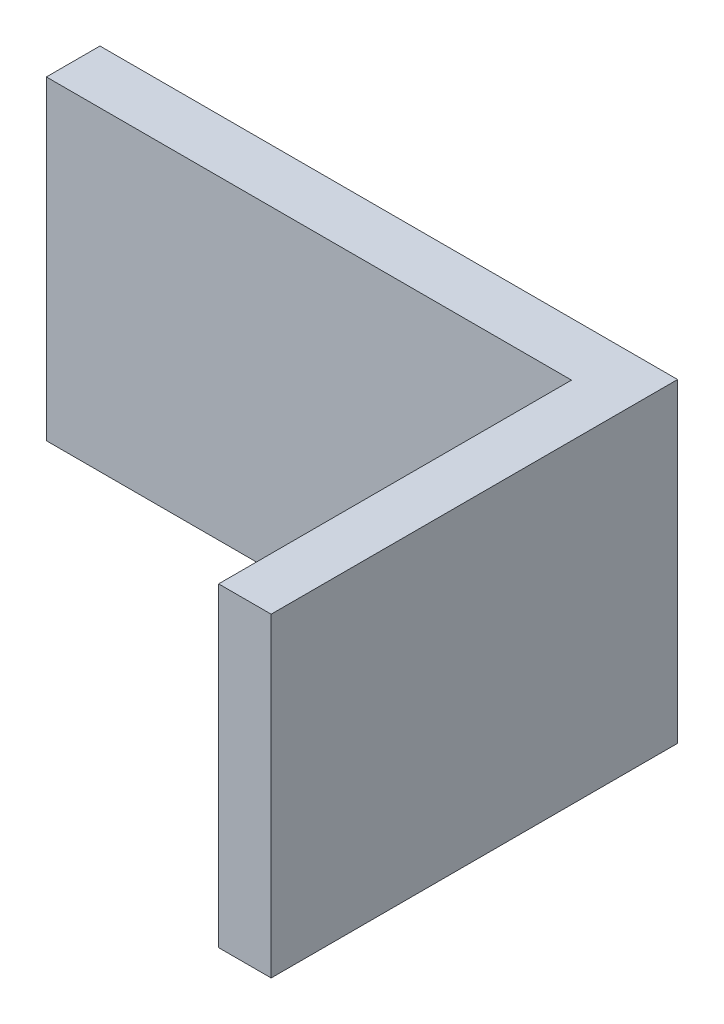
ISO-10303-21;
HEADER;
FILE_DESCRIPTION(('STEP AP214'),'2;1');
FILE_NAME('part.step','',(''),(''),'','','');
FILE_SCHEMA(('AUTOMOTIVE_DESIGN { 1 0 10303 214 1 1 1 1 }'));
ENDSEC;
DATA;
#1=APPLICATION_CONTEXT('core data for automotive mechanical design processes');
#2=APPLICATION_PROTOCOL_DEFINITION('international standard','automotive_design',2000,#1);
#3=PRODUCT_CONTEXT('',#1,'mechanical');
#4=PRODUCT('Part','Part','',(#3));
#5=PRODUCT_RELATED_PRODUCT_CATEGORY('part','',(#4));
#6=PRODUCT_DEFINITION_FORMATION('','',#4);
#7=PRODUCT_DEFINITION_CONTEXT('part definition',#1,'design');
#8=PRODUCT_DEFINITION('design','',#6,#7);
#9=PRODUCT_DEFINITION_SHAPE('','',#8);
#10=(LENGTH_UNIT() NAMED_UNIT(*) SI_UNIT(.MILLI.,.METRE.));
#11=(NAMED_UNIT(*) PLANE_ANGLE_UNIT() SI_UNIT($,.RADIAN.));
#12=(NAMED_UNIT(*) SI_UNIT($,.STERADIAN.) SOLID_ANGLE_UNIT());
#13=UNCERTAINTY_MEASURE_WITH_UNIT(LENGTH_MEASURE(1.E-05),#10,'distance_accuracy_value','');
#14=(GEOMETRIC_REPRESENTATION_CONTEXT(3) GLOBAL_UNCERTAINTY_ASSIGNED_CONTEXT((#13)) GLOBAL_UNIT_ASSIGNED_CONTEXT((#10,
#11,#12)) REPRESENTATION_CONTEXT('',''));
#15=CARTESIAN_POINT('',(0.,0.,0.));
#16=DIRECTION('',(0.,0.,1.));
#17=DIRECTION('',(1.,0.,0.));
#18=AXIS2_PLACEMENT_3D('',#15,#16,#17);
#19=CARTESIAN_POINT('',(4.55,-0.6,0.));
#20=DIRECTION('',(0.,1.,0.));
#21=DIRECTION('',(0.,0.,1.));
#22=AXIS2_PLACEMENT_3D('',#19,#20,#21);
#23=PLANE('',#22);
#24=DIRECTION('',(1.,0.,0.));
#25=VECTOR('',#24,1.);
#26=CARTESIAN_POINT('',(4.,-0.6,0.));
#27=LINE('',#26,#25);
#28=CARTESIAN_POINT('',(4.,-0.6,0.));
#29=VERTEX_POINT('',#28);
#30=CARTESIAN_POINT('',(4.55,-0.6,0.));
#31=VERTEX_POINT('',#30);
#32=EDGE_CURVE('E11',#29,#31,#27,.T.);
#33=ORIENTED_EDGE('',*,*,#32,.F.);
#34=DIRECTION('',(0.,0.,-1.));
#35=VECTOR('',#34,1.);
#36=CARTESIAN_POINT('',(4.,-0.6,0.051));
#37=LINE('',#36,#35);
#38=CARTESIAN_POINT('',(4.,-0.6,0.051));
#39=VERTEX_POINT('',#38);
#40=EDGE_CURVE('E24',#39,#29,#37,.T.);
#41=ORIENTED_EDGE('',*,*,#40,.F.);
#42=DIRECTION('',(-1.,0.,0.));
#43=VECTOR('',#42,1.);
#44=CARTESIAN_POINT('',(4.5,-0.6,0.051));
#45=LINE('',#44,#43);
#46=CARTESIAN_POINT('',(4.5,-0.6,0.051));
#47=VERTEX_POINT('',#46);
#48=EDGE_CURVE('E87',#47,#39,#45,.T.);
#49=ORIENTED_EDGE('',*,*,#48,.F.);
#50=DIRECTION('',(0.,0.,-1.));
#51=VECTOR('',#50,1.);
#52=CARTESIAN_POINT('',(4.5,-0.6,0.387));
#53=LINE('',#52,#51);
#54=CARTESIAN_POINT('',(4.5,-0.6,0.387));
#55=VERTEX_POINT('',#54);
#56=EDGE_CURVE('E114',#55,#47,#53,.T.);
#57=ORIENTED_EDGE('',*,*,#56,.F.);
#58=DIRECTION('',(-1.,0.,0.));
#59=VECTOR('',#58,1.);
#60=CARTESIAN_POINT('',(4.55,-0.6,0.387));
#61=LINE('',#60,#59);
#62=CARTESIAN_POINT('',(4.55,-0.6,0.387));
#63=VERTEX_POINT('',#62);
#64=EDGE_CURVE('E111',#63,#55,#61,.T.);
#65=ORIENTED_EDGE('',*,*,#64,.F.);
#66=DIRECTION('',(0.,0.,1.));
#67=VECTOR('',#66,1.);
#68=CARTESIAN_POINT('',(4.55,-0.6,0.));
#69=LINE('',#68,#67);
#70=EDGE_CURVE('E108',#31,#63,#69,.T.);
#71=ORIENTED_EDGE('',*,*,#70,.F.);
#72=EDGE_LOOP('',(#33,#41,#49,#57,#65,#71));
#73=FACE_BOUND('',#72,.T.);
#74=ADVANCED_FACE('F17',(#73),#23,.T.);
#75=CARTESIAN_POINT('',(4.,-0.9,0.));
#76=DIRECTION('',(0.,-1.,0.));
#77=DIRECTION('',(0.,0.,1.));
#78=AXIS2_PLACEMENT_3D('',#75,#76,#77);
#79=PLANE('',#78);
#80=DIRECTION('',(-1.,0.,0.));
#81=VECTOR('',#80,1.);
#82=CARTESIAN_POINT('',(4.55,-0.9,0.));
#83=LINE('',#82,#81);
#84=CARTESIAN_POINT('',(4.55,-0.9,0.));
#85=VERTEX_POINT('',#84);
#86=CARTESIAN_POINT('',(4.,-0.9,0.));
#87=VERTEX_POINT('',#86);
#88=EDGE_CURVE('E106',#85,#87,#83,.T.);
#89=ORIENTED_EDGE('',*,*,#88,.F.);
#90=DIRECTION('',(0.,0.,-1.));
#91=VECTOR('',#90,1.);
#92=CARTESIAN_POINT('',(4.55,-0.9,0.387));
#93=LINE('',#92,#91);
#94=CARTESIAN_POINT('',(4.55,-0.9,0.387));
#95=VERTEX_POINT('',#94);
#96=EDGE_CURVE('E103',#95,#85,#93,.T.);
#97=ORIENTED_EDGE('',*,*,#96,.F.);
#98=DIRECTION('',(1.,0.,0.));
#99=VECTOR('',#98,1.);
#100=CARTESIAN_POINT('',(4.5,-0.9,0.387));
#101=LINE('',#100,#99);
#102=CARTESIAN_POINT('',(4.5,-0.9,0.387));
#103=VERTEX_POINT('',#102);
#104=EDGE_CURVE('E100',#103,#95,#101,.T.);
#105=ORIENTED_EDGE('',*,*,#104,.F.);
#106=DIRECTION('',(0.,0.,1.));
#107=VECTOR('',#106,1.);
#108=CARTESIAN_POINT('',(4.5,-0.9,0.051));
#109=LINE('',#108,#107);
#110=CARTESIAN_POINT('',(4.5,-0.9,0.051));
#111=VERTEX_POINT('',#110);
#112=EDGE_CURVE('E72',#111,#103,#109,.T.);
#113=ORIENTED_EDGE('',*,*,#112,.F.);
#114=DIRECTION('',(1.,0.,0.));
#115=VECTOR('',#114,1.);
#116=CARTESIAN_POINT('',(4.,-0.9,0.051));
#117=LINE('',#116,#115);
#118=CARTESIAN_POINT('',(4.,-0.9,0.051));
#119=VERTEX_POINT('',#118);
#120=EDGE_CURVE('E66',#119,#111,#117,.T.);
#121=ORIENTED_EDGE('',*,*,#120,.F.);
#122=DIRECTION('',(0.,0.,1.));
#123=VECTOR('',#122,1.);
#124=CARTESIAN_POINT('',(4.,-0.9,0.));
#125=LINE('',#124,#123);
#126=EDGE_CURVE('E69',#87,#119,#125,.T.);
#127=ORIENTED_EDGE('',*,*,#126,.F.);
#128=EDGE_LOOP('',(#89,#97,#105,#113,#121,#127));
#129=FACE_BOUND('',#128,.T.);
#130=ADVANCED_FACE('F68',(#129),#79,.T.);
#131=CARTESIAN_POINT('',(4.55,-0.6,0.387));
#132=DIRECTION('',(0.,0.,1.));
#133=DIRECTION('',(0.,1.,0.));
#134=AXIS2_PLACEMENT_3D('',#131,#132,#133);
#135=PLANE('',#134);
#136=ORIENTED_EDGE('',*,*,#64,.T.);
#137=DIRECTION('',(0.,1.,0.));
#138=VECTOR('',#137,1.);
#139=CARTESIAN_POINT('',(4.5,-0.9,0.387));
#140=LINE('',#139,#138);
#141=EDGE_CURVE('E83',#103,#55,#140,.T.);
#142=ORIENTED_EDGE('',*,*,#141,.F.);
#143=ORIENTED_EDGE('',*,*,#104,.T.);
#144=DIRECTION('',(0.,-1.,0.));
#145=VECTOR('',#144,1.);
#146=CARTESIAN_POINT('',(4.55,-0.6,0.387));
#147=LINE('',#146,#145);
#148=EDGE_CURVE('E88',#63,#95,#147,.T.);
#149=ORIENTED_EDGE('',*,*,#148,.F.);
#150=EDGE_LOOP('',(#136,#142,#143,#149));
#151=FACE_BOUND('',#150,.T.);
#152=ADVANCED_FACE('F125',(#151),#135,.T.);
#153=CARTESIAN_POINT('',(4.5,-0.6,0.051));
#154=DIRECTION('',(0.,0.,1.));
#155=DIRECTION('',(0.,1.,0.));
#156=AXIS2_PLACEMENT_3D('',#153,#154,#155);
#157=PLANE('',#156);
#158=ORIENTED_EDGE('',*,*,#48,.T.);
#159=DIRECTION('',(0.,1.,0.));
#160=VECTOR('',#159,1.);
#161=CARTESIAN_POINT('',(4.,-0.9,0.051));
#162=LINE('',#161,#160);
#163=EDGE_CURVE('E81',#119,#39,#162,.T.);
#164=ORIENTED_EDGE('',*,*,#163,.F.);
#165=ORIENTED_EDGE('',*,*,#120,.T.);
#166=DIRECTION('',(0.,-1.,0.));
#167=VECTOR('',#166,1.);
#168=CARTESIAN_POINT('',(4.5,-0.6,0.051));
#169=LINE('',#168,#167);
#170=EDGE_CURVE('E89',#47,#111,#169,.T.);
#171=ORIENTED_EDGE('',*,*,#170,.F.);
#172=EDGE_LOOP('',(#158,#164,#165,#171));
#173=FACE_BOUND('',#172,.T.);
#174=ADVANCED_FACE('F86',(#173),#157,.T.);
#175=CARTESIAN_POINT('',(4.55,-0.9,0.));
#176=DIRECTION('',(1.,0.,0.));
#177=DIRECTION('',(0.,0.,1.));
#178=AXIS2_PLACEMENT_3D('',#175,#176,#177);
#179=PLANE('',#178);
#180=DIRECTION('',(0.,-1.,0.));
#181=VECTOR('',#180,1.);
#182=CARTESIAN_POINT('',(4.55,-0.6,0.));
#183=LINE('',#182,#181);
#184=EDGE_CURVE('E93',#31,#85,#183,.T.);
#185=ORIENTED_EDGE('',*,*,#184,.F.);
#186=ORIENTED_EDGE('',*,*,#70,.T.);
#187=ORIENTED_EDGE('',*,*,#148,.T.);
#188=ORIENTED_EDGE('',*,*,#96,.T.);
#189=EDGE_LOOP('',(#185,#186,#187,#188));
#190=FACE_BOUND('',#189,.T.);
#191=ADVANCED_FACE('F121',(#190),#179,.T.);
#192=CARTESIAN_POINT('',(4.,-0.6,0.));
#193=DIRECTION('',(-1.,0.,0.));
#194=DIRECTION('',(0.,0.,1.));
#195=AXIS2_PLACEMENT_3D('',#192,#193,#194);
#196=PLANE('',#195);
#197=DIRECTION('',(0.,1.,0.));
#198=VECTOR('',#197,1.);
#199=CARTESIAN_POINT('',(4.,-0.9,0.));
#200=LINE('',#199,#198);
#201=EDGE_CURVE('E82',#87,#29,#200,.T.);
#202=ORIENTED_EDGE('',*,*,#201,.F.);
#203=ORIENTED_EDGE('',*,*,#126,.T.);
#204=ORIENTED_EDGE('',*,*,#163,.T.);
#205=ORIENTED_EDGE('',*,*,#40,.T.);
#206=EDGE_LOOP('',(#202,#203,#204,#205));
#207=FACE_BOUND('',#206,.T.);
#208=ADVANCED_FACE('F80',(#207),#196,.T.);
#209=CARTESIAN_POINT('',(4.5,-0.6,0.051));
#210=DIRECTION('',(-1.,0.,0.));
#211=DIRECTION('',(0.,0.,1.));
#212=AXIS2_PLACEMENT_3D('',#209,#210,#211);
#213=PLANE('',#212);
#214=ORIENTED_EDGE('',*,*,#170,.T.);
#215=ORIENTED_EDGE('',*,*,#112,.T.);
#216=ORIENTED_EDGE('',*,*,#141,.T.);
#217=ORIENTED_EDGE('',*,*,#56,.T.);
#218=EDGE_LOOP('',(#214,#215,#216,#217));
#219=FACE_BOUND('',#218,.T.);
#220=ADVANCED_FACE('F127',(#219),#213,.T.);
#221=CARTESIAN_POINT('',(4.55,-0.9,0.));
#222=DIRECTION('',(0.,0.,-1.));
#223=DIRECTION('',(0.,1.,0.));
#224=AXIS2_PLACEMENT_3D('',#221,#222,#223);
#225=PLANE('',#224);
#226=ORIENTED_EDGE('',*,*,#88,.T.);
#227=ORIENTED_EDGE('',*,*,#201,.T.);
#228=ORIENTED_EDGE('',*,*,#32,.T.);
#229=ORIENTED_EDGE('',*,*,#184,.T.);
#230=EDGE_LOOP('',(#226,#227,#228,#229));
#231=FACE_BOUND('',#230,.T.);
#232=ADVANCED_FACE('F117',(#231),#225,.T.);
#233=CLOSED_SHELL('',(#74,#130,#152,#174,#191,#208,#220,#232));
#234=MANIFOLD_SOLID_BREP('B1',#233);
#235=ADVANCED_BREP_SHAPE_REPRESENTATION('',(#18,#234),#14);
#236=SHAPE_DEFINITION_REPRESENTATION(#9,#235);
ENDSEC;
END-ISO-10303-21;
